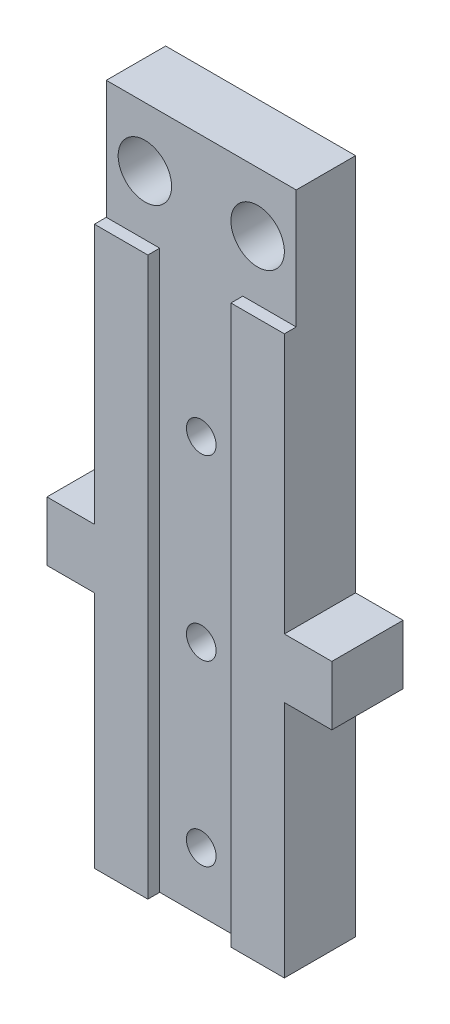
ISO-10303-21;
HEADER;
FILE_DESCRIPTION(('STEP AP214'),'2;1');
FILE_NAME('part.step','',(''),(''),'','','');
FILE_SCHEMA(('AUTOMOTIVE_DESIGN { 1 0 10303 214 1 1 1 1 }'));
ENDSEC;
DATA;
#1=APPLICATION_CONTEXT('core data for automotive mechanical design processes');
#2=APPLICATION_PROTOCOL_DEFINITION('international standard','automotive_design',2000,#1);
#3=PRODUCT_CONTEXT('',#1,'mechanical');
#4=PRODUCT('Part','Part','',(#3));
#5=PRODUCT_RELATED_PRODUCT_CATEGORY('part','',(#4));
#6=PRODUCT_DEFINITION_FORMATION('','',#4);
#7=PRODUCT_DEFINITION_CONTEXT('part definition',#1,'design');
#8=PRODUCT_DEFINITION('design','',#6,#7);
#9=PRODUCT_DEFINITION_SHAPE('','',#8);
#10=(LENGTH_UNIT() NAMED_UNIT(*) SI_UNIT(.MILLI.,.METRE.));
#11=(NAMED_UNIT(*) PLANE_ANGLE_UNIT() SI_UNIT($,.RADIAN.));
#12=(NAMED_UNIT(*) SI_UNIT($,.STERADIAN.) SOLID_ANGLE_UNIT());
#13=UNCERTAINTY_MEASURE_WITH_UNIT(LENGTH_MEASURE(1.E-05),#10,'distance_accuracy_value','');
#14=(GEOMETRIC_REPRESENTATION_CONTEXT(3) GLOBAL_UNCERTAINTY_ASSIGNED_CONTEXT((#13)) GLOBAL_UNIT_ASSIGNED_CONTEXT((#10,
#11,#12)) REPRESENTATION_CONTEXT('',''));
#15=CARTESIAN_POINT('',(0.,0.,0.));
#16=DIRECTION('',(0.,0.,1.));
#17=DIRECTION('',(1.,0.,0.));
#18=AXIS2_PLACEMENT_3D('',#15,#16,#17);
#19=CARTESIAN_POINT('',(0.,0.,6.));
#20=DIRECTION('',(0.,0.,-1.));
#21=DIRECTION('',(-1.,0.,0.));
#22=AXIS2_PLACEMENT_3D('',#19,#20,#21);
#23=PLANE('',#22);
#24=DIRECTION('',(1.,0.,0.));
#25=VECTOR('',#24,1.);
#26=CARTESIAN_POINT('',(0.,47.,6.));
#27=LINE('',#26,#25);
#28=CARTESIAN_POINT('',(11.5,47.,6.));
#29=VERTEX_POINT('',#28);
#30=CARTESIAN_POINT('',(16.,47.,6.));
#31=VERTEX_POINT('',#30);
#32=EDGE_CURVE('E180',#29,#31,#27,.T.);
#33=ORIENTED_EDGE('',*,*,#32,.F.);
#34=DIRECTION('',(0.,-1.,0.));
#35=VECTOR('',#34,1.);
#36=CARTESIAN_POINT('',(11.5,57.,6.));
#37=LINE('',#36,#35);
#38=CARTESIAN_POINT('',(11.5,0.,6.));
#39=VERTEX_POINT('',#38);
#40=EDGE_CURVE('E164',#29,#39,#37,.T.);
#41=ORIENTED_EDGE('',*,*,#40,.T.);
#42=DIRECTION('',(1.,0.,0.));
#43=VECTOR('',#42,1.);
#44=CARTESIAN_POINT('',(0.,0.,6.));
#45=LINE('',#44,#43);
#46=CARTESIAN_POINT('',(16.,0.,6.));
#47=VERTEX_POINT('',#46);
#48=EDGE_CURVE('E177',#39,#47,#45,.T.);
#49=ORIENTED_EDGE('',*,*,#48,.T.);
#50=DIRECTION('',(0.,1.,0.));
#51=VECTOR('',#50,1.);
#52=CARTESIAN_POINT('',(16.,0.,6.));
#53=LINE('',#52,#51);
#54=CARTESIAN_POINT('',(16.,20.1,6.));
#55=VERTEX_POINT('',#54);
#56=EDGE_CURVE('E198',#47,#55,#53,.T.);
#57=ORIENTED_EDGE('',*,*,#56,.T.);
#58=DIRECTION('',(-1.,0.,0.));
#59=VECTOR('',#58,1.);
#60=CARTESIAN_POINT('',(16.,20.1,6.));
#61=LINE('',#60,#59);
#62=CARTESIAN_POINT('',(20.,20.1,6.));
#63=VERTEX_POINT('',#62);
#64=EDGE_CURVE('E306',#63,#55,#61,.T.);
#65=ORIENTED_EDGE('',*,*,#64,.F.);
#66=DIRECTION('',(0.,-1.,0.));
#67=VECTOR('',#66,1.);
#68=CARTESIAN_POINT('',(20.,25.1,6.));
#69=LINE('',#68,#67);
#70=CARTESIAN_POINT('',(20.,25.1,6.));
#71=VERTEX_POINT('',#70);
#72=EDGE_CURVE('E302',#71,#63,#69,.T.);
#73=ORIENTED_EDGE('',*,*,#72,.F.);
#74=DIRECTION('',(1.,0.,0.));
#75=VECTOR('',#74,1.);
#76=CARTESIAN_POINT('',(16.,25.1,6.));
#77=LINE('',#76,#75);
#78=CARTESIAN_POINT('',(16.,25.1,6.));
#79=VERTEX_POINT('',#78);
#80=EDGE_CURVE('E299',#79,#71,#77,.T.);
#81=ORIENTED_EDGE('',*,*,#80,.F.);
#82=EDGE_CURVE('E192',#79,#31,#53,.T.);
#83=ORIENTED_EDGE('',*,*,#82,.T.);
#84=EDGE_LOOP('',(#33,#41,#49,#57,#65,#73,#81,#83));
#85=FACE_BOUND('',#84,.T.);
#86=ADVANCED_FACE('F37',(#85),#23,.F.);
#87=CARTESIAN_POINT('',(0.,47.,5.));
#88=DIRECTION('',(0.,-1.,0.));
#89=DIRECTION('',(0.,0.,-1.));
#90=AXIS2_PLACEMENT_3D('',#87,#88,#89);
#91=PLANE('',#90);
#92=DIRECTION('',(1.,0.,0.));
#93=VECTOR('',#92,1.);
#94=CARTESIAN_POINT('',(0.,47.,5.));
#95=LINE('',#94,#93);
#96=CARTESIAN_POINT('',(11.5,47.,5.));
#97=VERTEX_POINT('',#96);
#98=CARTESIAN_POINT('',(16.,47.,5.));
#99=VERTEX_POINT('',#98);
#100=EDGE_CURVE('E241',#97,#99,#95,.T.);
#101=ORIENTED_EDGE('',*,*,#100,.F.);
#102=DIRECTION('',(0.,0.,1.));
#103=VECTOR('',#102,1.);
#104=CARTESIAN_POINT('',(11.5,47.,4.99999999999998));
#105=LINE('',#104,#103);
#106=EDGE_CURVE('E11',#97,#29,#105,.T.);
#107=ORIENTED_EDGE('',*,*,#106,.T.);
#108=ORIENTED_EDGE('',*,*,#32,.T.);
#109=DIRECTION('',(0.,0.,1.));
#110=VECTOR('',#109,1.);
#111=CARTESIAN_POINT('',(16.,47.,6.));
#112=LINE('',#111,#110);
#113=EDGE_CURVE('E250',#99,#31,#112,.T.);
#114=ORIENTED_EDGE('',*,*,#113,.F.);
#115=EDGE_LOOP('',(#101,#107,#108,#114));
#116=FACE_BOUND('',#115,.T.);
#117=ADVANCED_FACE('F335',(#116),#91,.F.);
#118=CARTESIAN_POINT('',(0.,0.,6.));
#119=DIRECTION('',(1.,0.,0.));
#120=DIRECTION('',(0.,0.,-1.));
#121=AXIS2_PLACEMENT_3D('',#118,#119,#120);
#122=PLANE('',#121);
#123=DIRECTION('',(0.,0.,-1.));
#124=VECTOR('',#123,1.);
#125=CARTESIAN_POINT('',(0.,25.1,6.));
#126=LINE('',#125,#124);
#127=CARTESIAN_POINT('',(0.,25.1,6.));
#128=VERTEX_POINT('',#127);
#129=CARTESIAN_POINT('',(0.,25.1,0.));
#130=VERTEX_POINT('',#129);
#131=EDGE_CURVE('E279',#128,#130,#126,.T.);
#132=ORIENTED_EDGE('',*,*,#131,.F.);
#133=DIRECTION('',(0.,-1.,0.));
#134=VECTOR('',#133,1.);
#135=CARTESIAN_POINT('',(0.,0.,6.));
#136=LINE('',#135,#134);
#137=CARTESIAN_POINT('',(0.,47.,6.));
#138=VERTEX_POINT('',#137);
#139=EDGE_CURVE('E189',#138,#128,#136,.T.);
#140=ORIENTED_EDGE('',*,*,#139,.F.);
#141=DIRECTION('',(0.,0.,1.));
#142=VECTOR('',#141,1.);
#143=CARTESIAN_POINT('',(0.,47.,5.));
#144=LINE('',#143,#142);
#145=CARTESIAN_POINT('',(0.,47.,5.));
#146=VERTEX_POINT('',#145);
#147=EDGE_CURVE('E243',#146,#138,#144,.T.);
#148=ORIENTED_EDGE('',*,*,#147,.F.);
#149=DIRECTION('',(0.,-1.,0.));
#150=VECTOR('',#149,1.);
#151=CARTESIAN_POINT('',(0.,57.,5.));
#152=LINE('',#151,#150);
#153=CARTESIAN_POINT('',(0.,57.,5.));
#154=VERTEX_POINT('',#153);
#155=EDGE_CURVE('E238',#154,#146,#152,.T.);
#156=ORIENTED_EDGE('',*,*,#155,.F.);
#157=DIRECTION('',(0.,0.,-1.));
#158=VECTOR('',#157,1.);
#159=CARTESIAN_POINT('',(0.,57.,6.));
#160=LINE('',#159,#158);
#161=CARTESIAN_POINT('',(0.,57.,0.));
#162=VERTEX_POINT('',#161);
#163=EDGE_CURVE('E200',#154,#162,#160,.T.);
#164=ORIENTED_EDGE('',*,*,#163,.T.);
#165=DIRECTION('',(0.,-1.,0.));
#166=VECTOR('',#165,1.);
#167=CARTESIAN_POINT('',(0.,0.,0.));
#168=LINE('',#167,#166);
#169=EDGE_CURVE('E201',#162,#130,#168,.T.);
#170=ORIENTED_EDGE('',*,*,#169,.T.);
#171=EDGE_LOOP('',(#132,#140,#148,#156,#164,#170));
#172=FACE_BOUND('',#171,.T.);
#173=ADVANCED_FACE('F349',(#172),#122,.F.);
#174=CARTESIAN_POINT('',(16.,0.,6.));
#175=DIRECTION('',(-1.,0.,0.));
#176=DIRECTION('',(0.,-1.,0.));
#177=AXIS2_PLACEMENT_3D('',#174,#175,#176);
#178=PLANE('',#177);
#179=DIRECTION('',(0.,0.,-1.));
#180=VECTOR('',#179,1.);
#181=CARTESIAN_POINT('',(16.,20.1,6.));
#182=LINE('',#181,#180);
#183=CARTESIAN_POINT('',(16.,20.1,0.));
#184=VERTEX_POINT('',#183);
#185=EDGE_CURVE('E315',#55,#184,#182,.T.);
#186=ORIENTED_EDGE('',*,*,#185,.F.);
#187=ORIENTED_EDGE('',*,*,#56,.F.);
#188=DIRECTION('',(0.,0.,-1.));
#189=VECTOR('',#188,1.);
#190=CARTESIAN_POINT('',(16.,0.,6.));
#191=LINE('',#190,#189);
#192=CARTESIAN_POINT('',(16.,0.,0.));
#193=VERTEX_POINT('',#192);
#194=EDGE_CURVE('E186',#47,#193,#191,.T.);
#195=ORIENTED_EDGE('',*,*,#194,.T.);
#196=DIRECTION('',(0.,1.,0.));
#197=VECTOR('',#196,1.);
#198=CARTESIAN_POINT('',(16.,0.,0.));
#199=LINE('',#198,#197);
#200=EDGE_CURVE('E208',#193,#184,#199,.T.);
#201=ORIENTED_EDGE('',*,*,#200,.T.);
#202=EDGE_LOOP('',(#186,#187,#195,#201));
#203=FACE_BOUND('',#202,.T.);
#204=ADVANCED_FACE('F347',(#203),#178,.F.);
#205=CARTESIAN_POINT('',(0.,57.,6.));
#206=DIRECTION('',(0.,-1.,0.));
#207=DIRECTION('',(0.,0.,-1.));
#208=AXIS2_PLACEMENT_3D('',#205,#206,#207);
#209=PLANE('',#208);
#210=DIRECTION('',(-1.,0.,0.));
#211=VECTOR('',#210,1.);
#212=CARTESIAN_POINT('',(0.,57.,5.));
#213=LINE('',#212,#211);
#214=CARTESIAN_POINT('',(16.,57.,5.));
#215=VERTEX_POINT('',#214);
#216=EDGE_CURVE('E240',#215,#154,#213,.T.);
#217=ORIENTED_EDGE('',*,*,#216,.F.);
#218=DIRECTION('',(0.,0.,-1.));
#219=VECTOR('',#218,1.);
#220=CARTESIAN_POINT('',(16.,57.,6.));
#221=LINE('',#220,#219);
#222=CARTESIAN_POINT('',(16.,57.,0.));
#223=VERTEX_POINT('',#222);
#224=EDGE_CURVE('E215',#215,#223,#221,.T.);
#225=ORIENTED_EDGE('',*,*,#224,.T.);
#226=DIRECTION('',(-1.,0.,0.));
#227=VECTOR('',#226,1.);
#228=CARTESIAN_POINT('',(0.,57.,0.));
#229=LINE('',#228,#227);
#230=EDGE_CURVE('E211',#223,#162,#229,.T.);
#231=ORIENTED_EDGE('',*,*,#230,.T.);
#232=ORIENTED_EDGE('',*,*,#163,.F.);
#233=EDGE_LOOP('',(#217,#225,#231,#232));
#234=FACE_BOUND('',#233,.T.);
#235=ADVANCED_FACE('F331',(#234),#209,.F.);
#236=CARTESIAN_POINT('',(0.,20.1,6.));
#237=VERTEX_POINT('',#236);
#238=CARTESIAN_POINT('',(0.,0.,6.));
#239=VERTEX_POINT('',#238);
#240=EDGE_CURVE('E194',#237,#239,#136,.T.);
#241=ORIENTED_EDGE('',*,*,#240,.F.);
#242=DIRECTION('',(0.,0.,-1.));
#243=VECTOR('',#242,1.);
#244=CARTESIAN_POINT('',(0.,20.1,6.));
#245=LINE('',#244,#243);
#246=CARTESIAN_POINT('',(0.,20.1,0.));
#247=VERTEX_POINT('',#246);
#248=EDGE_CURVE('E260',#237,#247,#245,.T.);
#249=ORIENTED_EDGE('',*,*,#248,.T.);
#250=CARTESIAN_POINT('',(0.,0.,0.));
#251=VERTEX_POINT('',#250);
#252=EDGE_CURVE('E205',#247,#251,#168,.T.);
#253=ORIENTED_EDGE('',*,*,#252,.T.);
#254=DIRECTION('',(0.,0.,-1.));
#255=VECTOR('',#254,1.);
#256=CARTESIAN_POINT('',(0.,0.,6.));
#257=LINE('',#256,#255);
#258=EDGE_CURVE('E219',#239,#251,#257,.T.);
#259=ORIENTED_EDGE('',*,*,#258,.F.);
#260=EDGE_LOOP('',(#241,#249,#253,#259));
#261=FACE_BOUND('',#260,.T.);
#262=ADVANCED_FACE('F39',(#261),#122,.F.);
#263=CARTESIAN_POINT('',(0.,0.,6.));
#264=DIRECTION('',(0.,1.,0.));
#265=DIRECTION('',(0.,0.,1.));
#266=AXIS2_PLACEMENT_3D('',#263,#264,#265);
#267=PLANE('',#266);
#268=ORIENTED_EDGE('',*,*,#48,.F.);
#269=DIRECTION('',(0.,0.,1.));
#270=VECTOR('',#269,1.);
#271=CARTESIAN_POINT('',(11.5,0.,6.));
#272=LINE('',#271,#270);
#273=CARTESIAN_POINT('',(11.5,0.,5.));
#274=VERTEX_POINT('',#273);
#275=EDGE_CURVE('E161',#274,#39,#272,.T.);
#276=ORIENTED_EDGE('',*,*,#275,.F.);
#277=DIRECTION('',(1.,0.,0.));
#278=VECTOR('',#277,1.);
#279=CARTESIAN_POINT('',(11.5,0.,5.));
#280=LINE('',#279,#278);
#281=CARTESIAN_POINT('',(4.5,0.,5.));
#282=VERTEX_POINT('',#281);
#283=EDGE_CURVE('E182',#282,#274,#280,.T.);
#284=ORIENTED_EDGE('',*,*,#283,.F.);
#285=DIRECTION('',(0.,0.,-1.));
#286=VECTOR('',#285,1.);
#287=CARTESIAN_POINT('',(4.5,0.,6.));
#288=LINE('',#287,#286);
#289=CARTESIAN_POINT('',(4.5,0.,6.));
#290=VERTEX_POINT('',#289);
#291=EDGE_CURVE('E171',#290,#282,#288,.T.);
#292=ORIENTED_EDGE('',*,*,#291,.F.);
#293=EDGE_CURVE('E188',#239,#290,#45,.T.);
#294=ORIENTED_EDGE('',*,*,#293,.F.);
#295=ORIENTED_EDGE('',*,*,#258,.T.);
#296=DIRECTION('',(1.,0.,0.));
#297=VECTOR('',#296,1.);
#298=CARTESIAN_POINT('',(0.,0.,0.));
#299=LINE('',#298,#297);
#300=EDGE_CURVE('E204',#251,#193,#299,.T.);
#301=ORIENTED_EDGE('',*,*,#300,.T.);
#302=ORIENTED_EDGE('',*,*,#194,.F.);
#303=EDGE_LOOP('',(#268,#276,#284,#292,#294,#295,#301,#302));
#304=FACE_BOUND('',#303,.T.);
#305=ADVANCED_FACE('F184',(#304),#267,.F.);
#306=ORIENTED_EDGE('',*,*,#82,.F.);
#307=DIRECTION('',(0.,0.,-1.));
#308=VECTOR('',#307,1.);
#309=CARTESIAN_POINT('',(16.,25.1,6.));
#310=LINE('',#309,#308);
#311=CARTESIAN_POINT('',(16.,25.1,0.));
#312=VERTEX_POINT('',#311);
#313=EDGE_CURVE('E308',#79,#312,#310,.T.);
#314=ORIENTED_EDGE('',*,*,#313,.T.);
#315=EDGE_CURVE('E207',#312,#223,#199,.T.);
#316=ORIENTED_EDGE('',*,*,#315,.T.);
#317=ORIENTED_EDGE('',*,*,#224,.F.);
#318=DIRECTION('',(0.,1.,0.));
#319=VECTOR('',#318,1.);
#320=CARTESIAN_POINT('',(16.,0.,5.));
#321=LINE('',#320,#319);
#322=EDGE_CURVE('E252',#99,#215,#321,.T.);
#323=ORIENTED_EDGE('',*,*,#322,.F.);
#324=ORIENTED_EDGE('',*,*,#113,.T.);
#325=EDGE_LOOP('',(#306,#314,#316,#317,#323,#324));
#326=FACE_BOUND('',#325,.T.);
#327=ADVANCED_FACE('F324',(#326),#178,.F.);
#328=ORIENTED_EDGE('',*,*,#293,.T.);
#329=DIRECTION('',(0.,-1.,0.));
#330=VECTOR('',#329,1.);
#331=CARTESIAN_POINT('',(4.5,57.,6.));
#332=LINE('',#331,#330);
#333=CARTESIAN_POINT('',(4.5,47.,6.));
#334=VERTEX_POINT('',#333);
#335=EDGE_CURVE('E181',#334,#290,#332,.T.);
#336=ORIENTED_EDGE('',*,*,#335,.F.);
#337=EDGE_CURVE('E232',#138,#334,#27,.T.);
#338=ORIENTED_EDGE('',*,*,#337,.F.);
#339=ORIENTED_EDGE('',*,*,#139,.T.);
#340=DIRECTION('',(1.,0.,0.));
#341=VECTOR('',#340,1.);
#342=CARTESIAN_POINT('',(0.,25.1,6.));
#343=LINE('',#342,#341);
#344=CARTESIAN_POINT('',(-4.,25.1,6.));
#345=VERTEX_POINT('',#344);
#346=EDGE_CURVE('E277',#345,#128,#343,.T.);
#347=ORIENTED_EDGE('',*,*,#346,.F.);
#348=DIRECTION('',(0.,1.,0.));
#349=VECTOR('',#348,1.);
#350=CARTESIAN_POINT('',(-4.,25.1,6.));
#351=LINE('',#350,#349);
#352=CARTESIAN_POINT('',(-4.,20.1,6.));
#353=VERTEX_POINT('',#352);
#354=EDGE_CURVE('E276',#353,#345,#351,.T.);
#355=ORIENTED_EDGE('',*,*,#354,.F.);
#356=DIRECTION('',(-1.,0.,0.));
#357=VECTOR('',#356,1.);
#358=CARTESIAN_POINT('',(0.,20.1,6.));
#359=LINE('',#358,#357);
#360=EDGE_CURVE('E273',#237,#353,#359,.T.);
#361=ORIENTED_EDGE('',*,*,#360,.F.);
#362=ORIENTED_EDGE('',*,*,#240,.T.);
#363=EDGE_LOOP('',(#328,#336,#338,#339,#347,#355,#361,#362));
#364=FACE_BOUND('',#363,.T.);
#365=ADVANCED_FACE('F269',(#364),#23,.F.);
#366=CARTESIAN_POINT('',(0.,0.,0.));
#367=DIRECTION('',(0.,0.,-1.));
#368=DIRECTION('',(-1.,0.,0.));
#369=AXIS2_PLACEMENT_3D('',#366,#367,#368);
#370=PLANE('',#369);
#371=CARTESIAN_POINT('',(12.75,52.,0.));
#372=DIRECTION('',(0.,0.,1.));
#373=DIRECTION('',(-1.,0.,0.));
#374=AXIS2_PLACEMENT_3D('',#371,#372,#373);
#375=CIRCLE('',#374,2.25);
#376=CARTESIAN_POINT('',(10.5,52.,0.));
#377=VERTEX_POINT('',#376);
#378=EDGE_CURVE('E379',#377,#377,#375,.T.);
#379=ORIENTED_EDGE('',*,*,#378,.T.);
#380=EDGE_LOOP('',(#379));
#381=FACE_BOUND('',#380,.T.);
#382=CARTESIAN_POINT('',(3.25,52.,0.));
#383=DIRECTION('',(0.,0.,1.));
#384=DIRECTION('',(1.,0.,0.));
#385=AXIS2_PLACEMENT_3D('',#382,#383,#384);
#386=CIRCLE('',#385,2.25);
#387=CARTESIAN_POINT('',(5.5,52.,0.));
#388=VERTEX_POINT('',#387);
#389=EDGE_CURVE('E172',#388,#388,#386,.T.);
#390=ORIENTED_EDGE('',*,*,#389,.T.);
#391=EDGE_LOOP('',(#390));
#392=FACE_BOUND('',#391,.T.);
#393=CARTESIAN_POINT('',(7.99999999999999,35.,0.));
#394=DIRECTION('',(0.,0.,-1.));
#395=DIRECTION('',(-1.,0.,0.));
#396=AXIS2_PLACEMENT_3D('',#393,#394,#395);
#397=CIRCLE('',#396,1.25);
#398=CARTESIAN_POINT('',(6.74999999999999,35.,0.));
#399=VERTEX_POINT('',#398);
#400=EDGE_CURVE('E386',#399,#399,#397,.T.);
#401=ORIENTED_EDGE('',*,*,#400,.F.);
#402=EDGE_LOOP('',(#401));
#403=FACE_BOUND('',#402,.T.);
#404=CARTESIAN_POINT('',(7.99999999999999,20.,0.));
#405=DIRECTION('',(0.,0.,-1.));
#406=DIRECTION('',(-1.,0.,0.));
#407=AXIS2_PLACEMENT_3D('',#404,#405,#406);
#408=CIRCLE('',#407,1.25);
#409=CARTESIAN_POINT('',(6.74999999999999,20.,0.));
#410=VERTEX_POINT('',#409);
#411=EDGE_CURVE('E390',#410,#410,#408,.T.);
#412=ORIENTED_EDGE('',*,*,#411,.F.);
#413=EDGE_LOOP('',(#412));
#414=FACE_BOUND('',#413,.T.);
#415=CARTESIAN_POINT('',(7.99999999999999,5.00000000000001,0.));
#416=DIRECTION('',(0.,0.,-1.));
#417=DIRECTION('',(-1.,0.,0.));
#418=AXIS2_PLACEMENT_3D('',#415,#416,#417);
#419=CIRCLE('',#418,1.25);
#420=CARTESIAN_POINT('',(6.74999999999999,5.00000000000001,0.));
#421=VERTEX_POINT('',#420);
#422=EDGE_CURVE('E288',#421,#421,#419,.T.);
#423=ORIENTED_EDGE('',*,*,#422,.F.);
#424=EDGE_LOOP('',(#423));
#425=FACE_BOUND('',#424,.T.);
#426=ORIENTED_EDGE('',*,*,#169,.F.);
#427=ORIENTED_EDGE('',*,*,#230,.F.);
#428=ORIENTED_EDGE('',*,*,#315,.F.);
#429=DIRECTION('',(1.,0.,0.));
#430=VECTOR('',#429,1.);
#431=CARTESIAN_POINT('',(16.,25.1,0.));
#432=LINE('',#431,#430);
#433=CARTESIAN_POINT('',(20.,25.1,0.));
#434=VERTEX_POINT('',#433);
#435=EDGE_CURVE('E294',#312,#434,#432,.T.);
#436=ORIENTED_EDGE('',*,*,#435,.T.);
#437=DIRECTION('',(0.,-1.,0.));
#438=VECTOR('',#437,1.);
#439=CARTESIAN_POINT('',(20.,25.1,0.));
#440=LINE('',#439,#438);
#441=CARTESIAN_POINT('',(20.,20.1,0.));
#442=VERTEX_POINT('',#441);
#443=EDGE_CURVE('E311',#434,#442,#440,.T.);
#444=ORIENTED_EDGE('',*,*,#443,.T.);
#445=DIRECTION('',(-1.,0.,0.));
#446=VECTOR('',#445,1.);
#447=CARTESIAN_POINT('',(16.,20.1,0.));
#448=LINE('',#447,#446);
#449=EDGE_CURVE('E303',#442,#184,#448,.T.);
#450=ORIENTED_EDGE('',*,*,#449,.T.);
#451=ORIENTED_EDGE('',*,*,#200,.F.);
#452=ORIENTED_EDGE('',*,*,#300,.F.);
#453=ORIENTED_EDGE('',*,*,#252,.F.);
#454=DIRECTION('',(-1.,0.,0.));
#455=VECTOR('',#454,1.);
#456=CARTESIAN_POINT('',(0.,20.1,0.));
#457=LINE('',#456,#455);
#458=CARTESIAN_POINT('',(-4.,20.1,0.));
#459=VERTEX_POINT('',#458);
#460=EDGE_CURVE('E60',#247,#459,#457,.T.);
#461=ORIENTED_EDGE('',*,*,#460,.T.);
#462=DIRECTION('',(0.,1.,0.));
#463=VECTOR('',#462,1.);
#464=CARTESIAN_POINT('',(-4.,25.1,0.));
#465=LINE('',#464,#463);
#466=CARTESIAN_POINT('',(-4.,25.1,0.));
#467=VERTEX_POINT('',#466);
#468=EDGE_CURVE('E281',#459,#467,#465,.T.);
#469=ORIENTED_EDGE('',*,*,#468,.T.);
#470=DIRECTION('',(1.,0.,0.));
#471=VECTOR('',#470,1.);
#472=CARTESIAN_POINT('',(0.,25.1,0.));
#473=LINE('',#472,#471);
#474=EDGE_CURVE('E285',#467,#130,#473,.T.);
#475=ORIENTED_EDGE('',*,*,#474,.T.);
#476=EDGE_LOOP('',(#426,#427,#428,#436,#444,#450,#451,#452,#453,#461,#469,#475));
#477=FACE_BOUND('',#476,.T.);
#478=ADVANCED_FACE('F264',(#381,#392,#403,#414,#425,#477),#370,.T.);
#479=CARTESIAN_POINT('',(0.,0.,5.));
#480=DIRECTION('',(0.,0.,1.));
#481=DIRECTION('',(1.,0.,0.));
#482=AXIS2_PLACEMENT_3D('',#479,#480,#481);
#483=PLANE('',#482);
#484=CARTESIAN_POINT('',(12.75,52.,5.));
#485=DIRECTION('',(0.,0.,1.));
#486=DIRECTION('',(-1.,0.,0.));
#487=AXIS2_PLACEMENT_3D('',#484,#485,#486);
#488=CIRCLE('',#487,2.25);
#489=CARTESIAN_POINT('',(10.5,52.,5.));
#490=VERTEX_POINT('',#489);
#491=EDGE_CURVE('E411',#490,#490,#488,.T.);
#492=ORIENTED_EDGE('',*,*,#491,.F.);
#493=EDGE_LOOP('',(#492));
#494=FACE_BOUND('',#493,.T.);
#495=CARTESIAN_POINT('',(3.25,52.,5.));
#496=DIRECTION('',(0.,0.,1.));
#497=DIRECTION('',(1.,0.,0.));
#498=AXIS2_PLACEMENT_3D('',#495,#496,#497);
#499=CIRCLE('',#498,2.25);
#500=CARTESIAN_POINT('',(5.5,52.,5.));
#501=VERTEX_POINT('',#500);
#502=EDGE_CURVE('E407',#501,#501,#499,.T.);
#503=ORIENTED_EDGE('',*,*,#502,.F.);
#504=EDGE_LOOP('',(#503));
#505=FACE_BOUND('',#504,.T.);
#506=CARTESIAN_POINT('',(4.5,47.,5.));
#507=VERTEX_POINT('',#506);
#508=EDGE_CURVE('E229',#146,#507,#95,.T.);
#509=ORIENTED_EDGE('',*,*,#508,.T.);
#510=DIRECTION('',(0.,-1.,0.));
#511=VECTOR('',#510,1.);
#512=CARTESIAN_POINT('',(4.5,57.,5.));
#513=LINE('',#512,#511);
#514=EDGE_CURVE('E52',#507,#282,#513,.T.);
#515=ORIENTED_EDGE('',*,*,#514,.T.);
#516=ORIENTED_EDGE('',*,*,#283,.T.);
#517=DIRECTION('',(0.,-1.,0.));
#518=VECTOR('',#517,1.);
#519=CARTESIAN_POINT('',(11.5,57.,5.));
#520=LINE('',#519,#518);
#521=EDGE_CURVE('E166',#97,#274,#520,.T.);
#522=ORIENTED_EDGE('',*,*,#521,.F.);
#523=ORIENTED_EDGE('',*,*,#100,.T.);
#524=ORIENTED_EDGE('',*,*,#322,.T.);
#525=ORIENTED_EDGE('',*,*,#216,.T.);
#526=ORIENTED_EDGE('',*,*,#155,.T.);
#527=EDGE_LOOP('',(#509,#515,#516,#522,#523,#524,#525,#526));
#528=FACE_BOUND('',#527,.T.);
#529=CARTESIAN_POINT('',(7.99999999999999,20.,5.));
#530=DIRECTION('',(0.,0.,-1.));
#531=DIRECTION('',(-1.,0.,0.));
#532=AXIS2_PLACEMENT_3D('',#529,#530,#531);
#533=CIRCLE('',#532,1.25);
#534=CARTESIAN_POINT('',(6.74999999999999,20.,5.));
#535=VERTEX_POINT('',#534);
#536=EDGE_CURVE('E224',#535,#535,#533,.F.);
#537=ORIENTED_EDGE('',*,*,#536,.F.);
#538=EDGE_LOOP('',(#537));
#539=FACE_BOUND('',#538,.T.);
#540=CARTESIAN_POINT('',(7.99999999999999,35.,5.));
#541=DIRECTION('',(0.,0.,-1.));
#542=DIRECTION('',(-1.,0.,0.));
#543=AXIS2_PLACEMENT_3D('',#540,#541,#542);
#544=CIRCLE('',#543,1.25);
#545=CARTESIAN_POINT('',(6.74999999999999,35.,5.));
#546=VERTEX_POINT('',#545);
#547=EDGE_CURVE('E222',#546,#546,#544,.F.);
#548=ORIENTED_EDGE('',*,*,#547,.F.);
#549=EDGE_LOOP('',(#548));
#550=FACE_BOUND('',#549,.T.);
#551=CARTESIAN_POINT('',(7.99999999999999,5.00000000000001,5.));
#552=DIRECTION('',(0.,0.,-1.));
#553=DIRECTION('',(-1.,0.,0.));
#554=AXIS2_PLACEMENT_3D('',#551,#552,#553);
#555=CIRCLE('',#554,1.25);
#556=CARTESIAN_POINT('',(6.74999999999999,5.00000000000001,5.));
#557=VERTEX_POINT('',#556);
#558=EDGE_CURVE('E397',#557,#557,#555,.F.);
#559=ORIENTED_EDGE('',*,*,#558,.F.);
#560=EDGE_LOOP('',(#559));
#561=FACE_BOUND('',#560,.T.);
#562=ADVANCED_FACE('F235',(#494,#505,#528,#539,#550,#561),#483,.T.);
#563=ORIENTED_EDGE('',*,*,#337,.T.);
#564=DIRECTION('',(0.,0.,-1.));
#565=VECTOR('',#564,1.);
#566=CARTESIAN_POINT('',(4.5,47.,5.));
#567=LINE('',#566,#565);
#568=EDGE_CURVE('E45',#334,#507,#567,.T.);
#569=ORIENTED_EDGE('',*,*,#568,.T.);
#570=ORIENTED_EDGE('',*,*,#508,.F.);
#571=ORIENTED_EDGE('',*,*,#147,.T.);
#572=EDGE_LOOP('',(#563,#569,#570,#571));
#573=FACE_BOUND('',#572,.T.);
#574=ADVANCED_FACE('F228',(#573),#91,.F.);
#575=CARTESIAN_POINT('',(16.,20.1,6.));
#576=DIRECTION('',(0.,-1.,0.));
#577=DIRECTION('',(0.,0.,-1.));
#578=AXIS2_PLACEMENT_3D('',#575,#576,#577);
#579=PLANE('',#578);
#580=ORIENTED_EDGE('',*,*,#449,.F.);
#581=DIRECTION('',(0.,0.,-1.));
#582=VECTOR('',#581,1.);
#583=CARTESIAN_POINT('',(20.,20.1,6.));
#584=LINE('',#583,#582);
#585=EDGE_CURVE('E317',#63,#442,#584,.T.);
#586=ORIENTED_EDGE('',*,*,#585,.F.);
#587=ORIENTED_EDGE('',*,*,#64,.T.);
#588=ORIENTED_EDGE('',*,*,#185,.T.);
#589=EDGE_LOOP('',(#580,#586,#587,#588));
#590=FACE_BOUND('',#589,.T.);
#591=ADVANCED_FACE('F344',(#590),#579,.T.);
#592=CARTESIAN_POINT('',(20.,25.1,6.));
#593=DIRECTION('',(1.,0.,0.));
#594=DIRECTION('',(0.,0.,-1.));
#595=AXIS2_PLACEMENT_3D('',#592,#593,#594);
#596=PLANE('',#595);
#597=ORIENTED_EDGE('',*,*,#443,.F.);
#598=DIRECTION('',(0.,0.,-1.));
#599=VECTOR('',#598,1.);
#600=CARTESIAN_POINT('',(20.,25.1,6.));
#601=LINE('',#600,#599);
#602=EDGE_CURVE('E319',#71,#434,#601,.T.);
#603=ORIENTED_EDGE('',*,*,#602,.F.);
#604=ORIENTED_EDGE('',*,*,#72,.T.);
#605=ORIENTED_EDGE('',*,*,#585,.T.);
#606=EDGE_LOOP('',(#597,#603,#604,#605));
#607=FACE_BOUND('',#606,.T.);
#608=ADVANCED_FACE('F341',(#607),#596,.T.);
#609=CARTESIAN_POINT('',(16.,25.1,6.));
#610=DIRECTION('',(0.,1.,0.));
#611=DIRECTION('',(0.,0.,1.));
#612=AXIS2_PLACEMENT_3D('',#609,#610,#611);
#613=PLANE('',#612);
#614=ORIENTED_EDGE('',*,*,#435,.F.);
#615=ORIENTED_EDGE('',*,*,#313,.F.);
#616=ORIENTED_EDGE('',*,*,#80,.T.);
#617=ORIENTED_EDGE('',*,*,#602,.T.);
#618=EDGE_LOOP('',(#614,#615,#616,#617));
#619=FACE_BOUND('',#618,.T.);
#620=ADVANCED_FACE('F338',(#619),#613,.T.);
#621=CARTESIAN_POINT('',(0.,25.1,6.));
#622=DIRECTION('',(0.,1.,0.));
#623=DIRECTION('',(0.,0.,1.));
#624=AXIS2_PLACEMENT_3D('',#621,#622,#623);
#625=PLANE('',#624);
#626=ORIENTED_EDGE('',*,*,#474,.F.);
#627=DIRECTION('',(0.,0.,-1.));
#628=VECTOR('',#627,1.);
#629=CARTESIAN_POINT('',(-4.,25.1,6.));
#630=LINE('',#629,#628);
#631=EDGE_CURVE('E292',#345,#467,#630,.T.);
#632=ORIENTED_EDGE('',*,*,#631,.F.);
#633=ORIENTED_EDGE('',*,*,#346,.T.);
#634=ORIENTED_EDGE('',*,*,#131,.T.);
#635=EDGE_LOOP('',(#626,#632,#633,#634));
#636=FACE_BOUND('',#635,.T.);
#637=ADVANCED_FACE('F451',(#636),#625,.T.);
#638=CARTESIAN_POINT('',(-4.,25.1,6.));
#639=DIRECTION('',(-1.,0.,0.));
#640=DIRECTION('',(0.,-1.,0.));
#641=AXIS2_PLACEMENT_3D('',#638,#639,#640);
#642=PLANE('',#641);
#643=ORIENTED_EDGE('',*,*,#468,.F.);
#644=DIRECTION('',(0.,0.,-1.));
#645=VECTOR('',#644,1.);
#646=CARTESIAN_POINT('',(-4.,20.1,6.));
#647=LINE('',#646,#645);
#648=EDGE_CURVE('E295',#353,#459,#647,.T.);
#649=ORIENTED_EDGE('',*,*,#648,.F.);
#650=ORIENTED_EDGE('',*,*,#354,.T.);
#651=ORIENTED_EDGE('',*,*,#631,.T.);
#652=EDGE_LOOP('',(#643,#649,#650,#651));
#653=FACE_BOUND('',#652,.T.);
#654=ADVANCED_FACE('F448',(#653),#642,.T.);
#655=CARTESIAN_POINT('',(0.,20.1,6.));
#656=DIRECTION('',(0.,-1.,0.));
#657=DIRECTION('',(0.,0.,-1.));
#658=AXIS2_PLACEMENT_3D('',#655,#656,#657);
#659=PLANE('',#658);
#660=ORIENTED_EDGE('',*,*,#460,.F.);
#661=ORIENTED_EDGE('',*,*,#248,.F.);
#662=ORIENTED_EDGE('',*,*,#360,.T.);
#663=ORIENTED_EDGE('',*,*,#648,.T.);
#664=EDGE_LOOP('',(#660,#661,#662,#663));
#665=FACE_BOUND('',#664,.T.);
#666=ADVANCED_FACE('F446',(#665),#659,.T.);
#667=CARTESIAN_POINT('',(7.99999999999999,5.00000000000001,0.));
#668=DIRECTION('',(0.,0.,-1.));
#669=DIRECTION('',(-1.,0.,0.));
#670=AXIS2_PLACEMENT_3D('',#667,#668,#669);
#671=CYLINDRICAL_SURFACE('',#670,1.25);
#672=ORIENTED_EDGE('',*,*,#558,.T.);
#673=EDGE_LOOP('',(#672));
#674=FACE_BOUND('',#673,.T.);
#675=ORIENTED_EDGE('',*,*,#422,.T.);
#676=EDGE_LOOP('',(#675));
#677=FACE_BOUND('',#676,.T.);
#678=ADVANCED_FACE('F442',(#674,#677),#671,.F.);
#679=CARTESIAN_POINT('',(7.99999999999999,20.,0.));
#680=DIRECTION('',(0.,0.,-1.));
#681=DIRECTION('',(-1.,0.,0.));
#682=AXIS2_PLACEMENT_3D('',#679,#680,#681);
#683=CYLINDRICAL_SURFACE('',#682,1.25);
#684=ORIENTED_EDGE('',*,*,#536,.T.);
#685=EDGE_LOOP('',(#684));
#686=FACE_BOUND('',#685,.T.);
#687=ORIENTED_EDGE('',*,*,#411,.T.);
#688=EDGE_LOOP('',(#687));
#689=FACE_BOUND('',#688,.T.);
#690=ADVANCED_FACE('F438',(#686,#689),#683,.F.);
#691=CARTESIAN_POINT('',(7.99999999999999,35.,0.));
#692=DIRECTION('',(0.,0.,-1.));
#693=DIRECTION('',(-1.,0.,0.));
#694=AXIS2_PLACEMENT_3D('',#691,#692,#693);
#695=CYLINDRICAL_SURFACE('',#694,1.25);
#696=ORIENTED_EDGE('',*,*,#547,.T.);
#697=EDGE_LOOP('',(#696));
#698=FACE_BOUND('',#697,.T.);
#699=ORIENTED_EDGE('',*,*,#400,.T.);
#700=EDGE_LOOP('',(#699));
#701=FACE_BOUND('',#700,.T.);
#702=ADVANCED_FACE('F435',(#698,#701),#695,.F.);
#703=CARTESIAN_POINT('',(11.5,57.,6.));
#704=DIRECTION('',(1.,0.,0.));
#705=DIRECTION('',(0.,0.,-1.));
#706=AXIS2_PLACEMENT_3D('',#703,#704,#705);
#707=PLANE('',#706);
#708=ORIENTED_EDGE('',*,*,#521,.T.);
#709=ORIENTED_EDGE('',*,*,#275,.T.);
#710=ORIENTED_EDGE('',*,*,#40,.F.);
#711=ORIENTED_EDGE('',*,*,#106,.F.);
#712=EDGE_LOOP('',(#708,#709,#710,#711));
#713=FACE_BOUND('',#712,.T.);
#714=ADVANCED_FACE('F163',(#713),#707,.F.);
#715=CARTESIAN_POINT('',(4.5,57.,6.));
#716=DIRECTION('',(-1.,0.,0.));
#717=DIRECTION('',(0.,0.,1.));
#718=AXIS2_PLACEMENT_3D('',#715,#716,#717);
#719=PLANE('',#718);
#720=ORIENTED_EDGE('',*,*,#335,.T.);
#721=ORIENTED_EDGE('',*,*,#291,.T.);
#722=ORIENTED_EDGE('',*,*,#514,.F.);
#723=ORIENTED_EDGE('',*,*,#568,.F.);
#724=EDGE_LOOP('',(#720,#721,#722,#723));
#725=FACE_BOUND('',#724,.T.);
#726=ADVANCED_FACE('F422',(#725),#719,.F.);
#727=CARTESIAN_POINT('',(3.25,52.,0.));
#728=DIRECTION('',(0.,0.,1.));
#729=DIRECTION('',(1.,0.,0.));
#730=AXIS2_PLACEMENT_3D('',#727,#728,#729);
#731=CYLINDRICAL_SURFACE('',#730,2.25);
#732=ORIENTED_EDGE('',*,*,#389,.F.);
#733=EDGE_LOOP('',(#732));
#734=FACE_BOUND('',#733,.T.);
#735=ORIENTED_EDGE('',*,*,#502,.T.);
#736=EDGE_LOOP('',(#735));
#737=FACE_BOUND('',#736,.T.);
#738=ADVANCED_FACE('F420',(#734,#737),#731,.F.);
#739=CARTESIAN_POINT('',(12.75,52.,0.));
#740=DIRECTION('',(0.,0.,1.));
#741=DIRECTION('',(1.,0.,0.));
#742=AXIS2_PLACEMENT_3D('',#739,#740,#741);
#743=CYLINDRICAL_SURFACE('',#742,2.25);
#744=ORIENTED_EDGE('',*,*,#378,.F.);
#745=EDGE_LOOP('',(#744));
#746=FACE_BOUND('',#745,.T.);
#747=ORIENTED_EDGE('',*,*,#491,.T.);
#748=EDGE_LOOP('',(#747));
#749=FACE_BOUND('',#748,.T.);
#750=ADVANCED_FACE('F416',(#746,#749),#743,.F.);
#751=CLOSED_SHELL('',(#86,#117,#173,#204,#235,#262,#305,#327,#365,#478,#562,#574,#591,#608,#620,
#637,#654,#666,#678,#690,#702,#714,#726,#738,#750));
#752=MANIFOLD_SOLID_BREP('B2',#751);
#753=ADVANCED_BREP_SHAPE_REPRESENTATION('',(#18,#752),#14);
#754=SHAPE_DEFINITION_REPRESENTATION(#9,#753);
ENDSEC;
END-ISO-10303-21;
